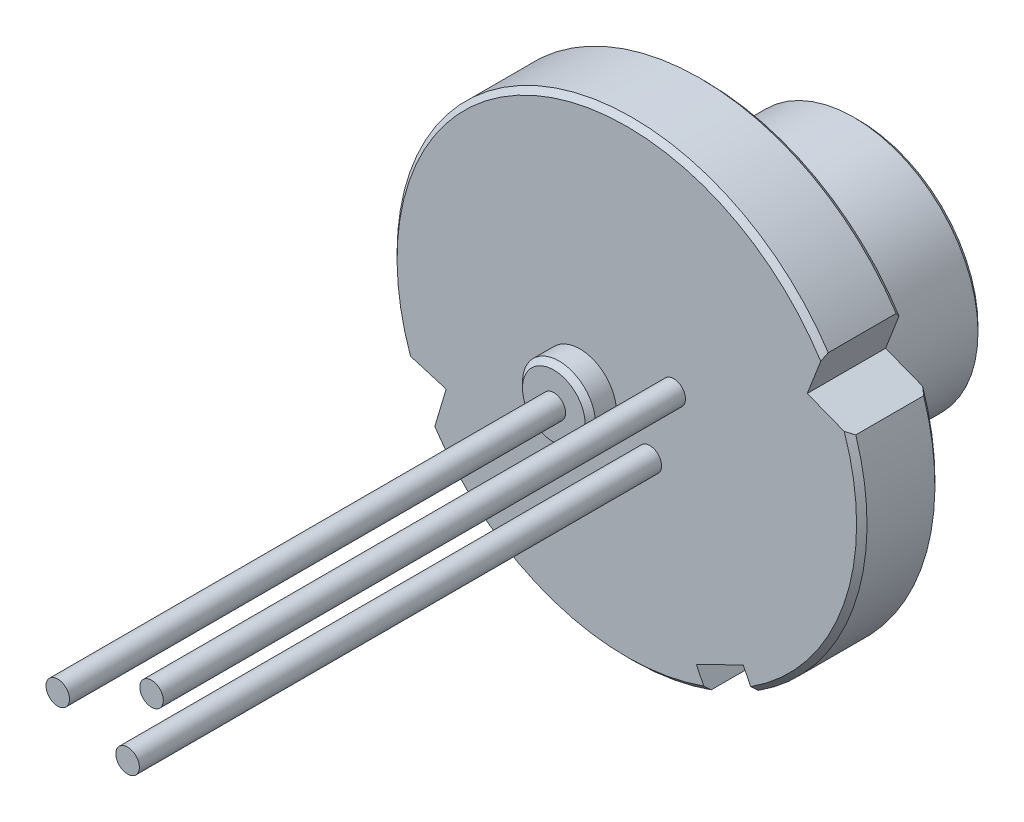
ISO-10303-21;
HEADER;
FILE_DESCRIPTION(('STEP AP214'),'2;1');
FILE_NAME('part.step','',(''),(''),'','','');
FILE_SCHEMA(('AUTOMOTIVE_DESIGN { 1 0 10303 214 1 1 1 1 }'));
ENDSEC;
DATA;
#1=APPLICATION_CONTEXT('core data for automotive mechanical design processes');
#2=APPLICATION_PROTOCOL_DEFINITION('international standard','automotive_design',2000,#1);
#3=PRODUCT_CONTEXT('',#1,'mechanical');
#4=PRODUCT('Part','Part','',(#3));
#5=PRODUCT_RELATED_PRODUCT_CATEGORY('part','',(#4));
#6=PRODUCT_DEFINITION_FORMATION('','',#4);
#7=PRODUCT_DEFINITION_CONTEXT('part definition',#1,'design');
#8=PRODUCT_DEFINITION('design','',#6,#7);
#9=PRODUCT_DEFINITION_SHAPE('','',#8);
#10=(LENGTH_UNIT() NAMED_UNIT(*) SI_UNIT(.MILLI.,.METRE.));
#11=(NAMED_UNIT(*) PLANE_ANGLE_UNIT() SI_UNIT($,.RADIAN.));
#12=(NAMED_UNIT(*) SI_UNIT($,.STERADIAN.) SOLID_ANGLE_UNIT());
#13=UNCERTAINTY_MEASURE_WITH_UNIT(LENGTH_MEASURE(1.E-05),#10,'distance_accuracy_value','');
#14=(GEOMETRIC_REPRESENTATION_CONTEXT(3) GLOBAL_UNCERTAINTY_ASSIGNED_CONTEXT((#13)) GLOBAL_UNIT_ASSIGNED_CONTEXT((#10,
#11,#12)) REPRESENTATION_CONTEXT('',''));
#15=CARTESIAN_POINT('',(0.,0.,0.));
#16=DIRECTION('',(0.,0.,1.));
#17=DIRECTION('',(1.,0.,0.));
#18=AXIS2_PLACEMENT_3D('',#15,#16,#17);
#19=CARTESIAN_POINT('',(0.,0.,2.5414));
#20=DIRECTION('',(0.,0.,-1.));
#21=DIRECTION('',(-0.898157902451115,-0.439673040183968,0.));
#22=AXIS2_PLACEMENT_3D('',#19,#20,#21);
#23=PLANE('',#22);
#24=CARTESIAN_POINT('',(0.439673040183968,-0.898157902451115,2.5414));
#25=DIRECTION('',(0.,0.,-1.));
#26=DIRECTION('',(-0.898157902451115,-0.439673040183968,0.));
#27=AXIS2_PLACEMENT_3D('',#24,#25,#26);
#28=CIRCLE('',#27,0.225);
#29=CARTESIAN_POINT('',(0.237587512132467,-0.997084336492508,2.5414));
#30=VERTEX_POINT('',#29);
#31=EDGE_CURVE('E217',#30,#30,#28,.F.);
#32=ORIENTED_EDGE('',*,*,#31,.F.);
#33=EDGE_LOOP('',(#32));
#34=FACE_BOUND('',#33,.T.);
#35=CARTESIAN_POINT('',(0.898157902451115,0.439673040183968,2.5414));
#36=DIRECTION('',(0.,0.,-1.));
#37=DIRECTION('',(-0.898157902451115,-0.439673040183968,0.));
#38=AXIS2_PLACEMENT_3D('',#35,#36,#37);
#39=CIRCLE('',#38,0.225);
#40=CARTESIAN_POINT('',(0.696072374399615,0.340746606142575,2.5414));
#41=VERTEX_POINT('',#40);
#42=EDGE_CURVE('E214',#41,#41,#39,.F.);
#43=ORIENTED_EDGE('',*,*,#42,.F.);
#44=EDGE_LOOP('',(#43));
#45=FACE_BOUND('',#44,.T.);
#46=DIRECTION('',(0.285871853448172,0.958267855772125,0.));
#47=VECTOR('',#46,1.);
#48=CARTESIAN_POINT('',(-3.46036549749903,-1.68771165301373,2.5414));
#49=LINE('',#48,#47);
#50=CARTESIAN_POINT('',(-3.67754397528226,-2.41571320935767,2.5414));
#51=VERTEX_POINT('',#50);
#52=CARTESIAN_POINT('',(-3.46036549749903,-1.68771165301373,2.5414));
#53=VERTEX_POINT('',#52);
#54=EDGE_CURVE('E189',#51,#53,#49,.T.);
#55=ORIENTED_EDGE('',*,*,#54,.F.);
#56=CARTESIAN_POINT('',(0.,0.,2.5414));
#57=DIRECTION('',(0.,0.,-1.));
#58=DIRECTION('',(-0.898157902451115,-0.439673040183968,0.));
#59=AXIS2_PLACEMENT_3D('',#56,#57,#58);
#60=CIRCLE('',#59,4.4);
#61=CARTESIAN_POINT('',(1.47295112790347,-4.14613253222903,2.5414));
#62=VERTEX_POINT('',#61);
#63=EDGE_CURVE('E470',#51,#62,#60,.F.);
#64=ORIENTED_EDGE('',*,*,#63,.T.);
#65=DIRECTION('',(0.439673040183968,-0.898157902451115,0.));
#66=VECTOR('',#65,1.);
#67=CARTESIAN_POINT('',(1.51719866022514,-4.23652076891062,2.5414));
#68=LINE('',#67,#66);
#69=CARTESIAN_POINT('',(1.33159686151951,-3.857376025019,2.5414));
#70=VERTEX_POINT('',#69);
#71=EDGE_CURVE('E186',#70,#62,#68,.T.);
#72=ORIENTED_EDGE('',*,*,#71,.F.);
#73=DIRECTION('',(-0.898157902451115,-0.439673040183968,0.));
#74=VECTOR('',#73,1.);
#75=CARTESIAN_POINT('',(2.22975476397063,-3.41770298483503,2.5414));
#76=LINE('',#75,#74);
#77=CARTESIAN_POINT('',(2.22975476397063,-3.41770298483503,2.5414));
#78=VERTEX_POINT('',#77);
#79=EDGE_CURVE('E184',#78,#70,#76,.T.);
#80=ORIENTED_EDGE('',*,*,#79,.F.);
#81=DIRECTION('',(-0.439673040183968,0.898157902451115,0.));
#82=VECTOR('',#81,1.);
#83=CARTESIAN_POINT('',(2.41535656267625,-3.79684772872665,2.5414));
#84=LINE('',#83,#82);
#85=CARTESIAN_POINT('',(2.37110903035459,-3.70645949204506,2.5414));
#86=VERTEX_POINT('',#85);
#87=EDGE_CURVE('E182',#86,#78,#84,.T.);
#88=ORIENTED_EDGE('',*,*,#87,.F.);
#89=CARTESIAN_POINT('',(0.,0.,2.5414));
#90=DIRECTION('',(0.,0.,-1.));
#91=DIRECTION('',(-0.898157902451115,-0.439673040183968,0.));
#92=AXIS2_PLACEMENT_3D('',#89,#90,#91);
#93=CIRCLE('',#92,4.4);
#94=CARTESIAN_POINT('',(4.16362447761335,1.4227547959571,2.5414));
#95=VERTEX_POINT('',#94);
#96=EDGE_CURVE('E474',#86,#95,#93,.F.);
#97=ORIENTED_EDGE('',*,*,#96,.T.);
#98=DIRECTION('',(0.932178648237255,-0.361998574265927,0.));
#99=VECTOR('',#98,1.);
#100=CARTESIAN_POINT('',(3.45544304105613,1.69776717780053,2.5414));
#101=LINE('',#100,#99);
#102=CARTESIAN_POINT('',(3.45544304105613,1.69776717780053,2.5414));
#103=VERTEX_POINT('',#102);
#104=EDGE_CURVE('E179',#103,#95,#101,.T.);
#105=ORIENTED_EDGE('',*,*,#104,.F.);
#106=DIRECTION('',(-0.361998574265929,-0.932178648237254,0.));
#107=VECTOR('',#106,1.);
#108=CARTESIAN_POINT('',(3.75763045998787,2.47592676106773,2.5414));
#109=LINE('',#108,#107);
#110=CARTESIAN_POINT('',(3.7129649281498,2.36090902881274,2.5414));
#111=VERTEX_POINT('',#110);
#112=EDGE_CURVE('E153',#111,#103,#109,.T.);
#113=ORIENTED_EDGE('',*,*,#112,.F.);
#114=CARTESIAN_POINT('',(0.,0.,2.5414));
#115=DIRECTION('',(0.,0.,-1.));
#116=DIRECTION('',(-0.898157902451115,-0.439673040183968,0.));
#117=AXIS2_PLACEMENT_3D('',#114,#115,#116);
#118=CIRCLE('',#117,4.4);
#119=CARTESIAN_POINT('',(-4.14206692977694,-1.48434549524301,2.5414));
#120=VERTEX_POINT('',#119);
#121=EDGE_CURVE('E475',#111,#120,#118,.F.);
#122=ORIENTED_EDGE('',*,*,#121,.T.);
#123=DIRECTION('',(-0.958267855772124,0.285871853448176,0.));
#124=VECTOR('',#123,1.);
#125=CARTESIAN_POINT('',(-3.46036549749903,-1.68771165301373,2.5414));
#126=LINE('',#125,#124);
#127=EDGE_CURVE('E146',#53,#120,#126,.T.);
#128=ORIENTED_EDGE('',*,*,#127,.F.);
#129=EDGE_LOOP('',(#55,#64,#72,#80,#88,#97,#105,#113,#122,#128));
#130=FACE_BOUND('',#129,.T.);
#131=CARTESIAN_POINT('',(-0.898157902451115,-0.439673040183968,2.5414));
#132=DIRECTION('',(0.,0.,-1.));
#133=DIRECTION('',(-0.898157902451115,-0.439673040183968,0.));
#134=AXIS2_PLACEMENT_3D('',#131,#132,#133);
#135=CIRCLE('',#134,0.7);
#136=CARTESIAN_POINT('',(-1.5268684341669,-0.747444168312745,2.5414));
#137=VERTEX_POINT('',#136);
#138=EDGE_CURVE('E220',#137,#137,#135,.F.);
#139=ORIENTED_EDGE('',*,*,#138,.F.);
#140=EDGE_LOOP('',(#139));
#141=FACE_BOUND('',#140,.T.);
#142=ADVANCED_FACE('F17',(#34,#45,#130,#141),#23,.F.);
#143=CARTESIAN_POINT('',(0.,0.,0.841399999999998));
#144=DIRECTION('',(0.,0.,-1.));
#145=DIRECTION('',(-0.898157902451115,-0.439673040183968,0.));
#146=AXIS2_PLACEMENT_3D('',#143,#144,#145);
#147=PLANE('',#146);
#148=CARTESIAN_POINT('',(0.,0.,0.841399999999998));
#149=DIRECTION('',(0.,0.,-1.));
#150=DIRECTION('',(-0.898157902451115,-0.439673040183968,0.));
#151=AXIS2_PLACEMENT_3D('',#148,#149,#150);
#152=CIRCLE('',#151,2.575);
#153=CARTESIAN_POINT('',(-2.31275659881162,-1.13215807847372,0.841399999999998));
#154=VERTEX_POINT('',#153);
#155=EDGE_CURVE('E342',#154,#154,#152,.T.);
#156=ORIENTED_EDGE('',*,*,#155,.T.);
#157=EDGE_LOOP('',(#156));
#158=FACE_BOUND('',#157,.T.);
#159=CARTESIAN_POINT('',(0.,0.,0.841399999999998));
#160=DIRECTION('',(0.,0.,-1.));
#161=DIRECTION('',(-0.898157902451115,-0.439673040183968,0.));
#162=AXIS2_PLACEMENT_3D('',#159,#160,#161);
#163=CIRCLE('',#162,2.375);
#164=CARTESIAN_POINT('',(-2.1331250183214,-1.04422347043692,0.841399999999998));
#165=VERTEX_POINT('',#164);
#166=EDGE_CURVE('E446',#165,#165,#163,.T.);
#167=ORIENTED_EDGE('',*,*,#166,.F.);
#168=EDGE_LOOP('',(#167));
#169=FACE_BOUND('',#168,.T.);
#170=ADVANCED_FACE('F363',(#158,#169),#147,.T.);
#171=CARTESIAN_POINT('',(0.,0.,1.0414));
#172=DIRECTION('',(0.,0.,-1.));
#173=DIRECTION('',(-0.898157902451115,-0.439673040183968,0.));
#174=AXIS2_PLACEMENT_3D('',#171,#172,#173);
#175=PLANE('',#174);
#176=DIRECTION('',(0.439673040183968,-0.898157902451115,0.));
#177=VECTOR('',#176,1.);
#178=CARTESIAN_POINT('',(1.51719866022514,-4.23652076891062,1.0414));
#179=LINE('',#178,#177);
#180=CARTESIAN_POINT('',(1.33159686151951,-3.857376025019,1.0414));
#181=VERTEX_POINT('',#180);
#182=CARTESIAN_POINT('',(1.47295112790348,-4.14613253222903,1.0414));
#183=VERTEX_POINT('',#182);
#184=EDGE_CURVE('E171',#181,#183,#179,.T.);
#185=ORIENTED_EDGE('',*,*,#184,.T.);
#186=CARTESIAN_POINT('',(0.,0.,1.0414));
#187=DIRECTION('',(0.,0.,-1.));
#188=DIRECTION('',(-0.898157902451115,-0.439673040183968,0.));
#189=AXIS2_PLACEMENT_3D('',#186,#187,#188);
#190=CIRCLE('',#189,4.4);
#191=CARTESIAN_POINT('',(-3.67754397528226,-2.41571320935767,1.0414));
#192=VERTEX_POINT('',#191);
#193=EDGE_CURVE('E486',#183,#192,#190,.T.);
#194=ORIENTED_EDGE('',*,*,#193,.T.);
#195=DIRECTION('',(0.285871853448172,0.958267855772125,0.));
#196=VECTOR('',#195,1.);
#197=CARTESIAN_POINT('',(-3.46036549749903,-1.68771165301373,1.0414));
#198=LINE('',#197,#196);
#199=CARTESIAN_POINT('',(-3.46036549749903,-1.68771165301373,1.0414));
#200=VERTEX_POINT('',#199);
#201=EDGE_CURVE('E173',#192,#200,#198,.T.);
#202=ORIENTED_EDGE('',*,*,#201,.T.);
#203=DIRECTION('',(-0.958267855772124,0.285871853448176,0.));
#204=VECTOR('',#203,1.);
#205=CARTESIAN_POINT('',(-3.46036549749903,-1.68771165301373,1.0414));
#206=LINE('',#205,#204);
#207=CARTESIAN_POINT('',(-4.14206692977694,-1.48434549524301,1.0414));
#208=VERTEX_POINT('',#207);
#209=EDGE_CURVE('E175',#200,#208,#206,.T.);
#210=ORIENTED_EDGE('',*,*,#209,.T.);
#211=CARTESIAN_POINT('',(0.,0.,1.0414));
#212=DIRECTION('',(0.,0.,-1.));
#213=DIRECTION('',(-0.898157902451115,-0.439673040183968,0.));
#214=AXIS2_PLACEMENT_3D('',#211,#212,#213);
#215=CIRCLE('',#214,4.4);
#216=CARTESIAN_POINT('',(3.7129649281498,2.36090902881274,1.0414));
#217=VERTEX_POINT('',#216);
#218=EDGE_CURVE('E144',#208,#217,#215,.T.);
#219=ORIENTED_EDGE('',*,*,#218,.T.);
#220=DIRECTION('',(-0.361998574265929,-0.932178648237254,0.));
#221=VECTOR('',#220,1.);
#222=CARTESIAN_POINT('',(3.75763045998787,2.47592676106773,1.0414));
#223=LINE('',#222,#221);
#224=CARTESIAN_POINT('',(3.45544304105613,1.69776717780053,1.0414));
#225=VERTEX_POINT('',#224);
#226=EDGE_CURVE('E133',#217,#225,#223,.T.);
#227=ORIENTED_EDGE('',*,*,#226,.T.);
#228=DIRECTION('',(0.932178648237255,-0.361998574265927,0.));
#229=VECTOR('',#228,1.);
#230=CARTESIAN_POINT('',(3.45544304105613,1.69776717780053,1.0414));
#231=LINE('',#230,#229);
#232=CARTESIAN_POINT('',(4.16362447761335,1.42275479595711,1.0414));
#233=VERTEX_POINT('',#232);
#234=EDGE_CURVE('E140',#225,#233,#231,.T.);
#235=ORIENTED_EDGE('',*,*,#234,.T.);
#236=CARTESIAN_POINT('',(0.,0.,1.0414));
#237=DIRECTION('',(0.,0.,-1.));
#238=DIRECTION('',(-0.898157902451115,-0.439673040183968,0.));
#239=AXIS2_PLACEMENT_3D('',#236,#237,#238);
#240=CIRCLE('',#239,4.4);
#241=CARTESIAN_POINT('',(2.37110903035459,-3.70645949204506,1.0414));
#242=VERTEX_POINT('',#241);
#243=EDGE_CURVE('E543',#233,#242,#240,.T.);
#244=ORIENTED_EDGE('',*,*,#243,.T.);
#245=DIRECTION('',(-0.439673040183968,0.898157902451115,0.));
#246=VECTOR('',#245,1.);
#247=CARTESIAN_POINT('',(2.41535656267625,-3.79684772872665,1.0414));
#248=LINE('',#247,#246);
#249=CARTESIAN_POINT('',(2.22975476397063,-3.41770298483503,1.0414));
#250=VERTEX_POINT('',#249);
#251=EDGE_CURVE('E164',#242,#250,#248,.T.);
#252=ORIENTED_EDGE('',*,*,#251,.T.);
#253=DIRECTION('',(-0.898157902451115,-0.439673040183968,0.));
#254=VECTOR('',#253,1.);
#255=CARTESIAN_POINT('',(2.22975476397063,-3.41770298483503,1.0414));
#256=LINE('',#255,#254);
#257=EDGE_CURVE('E166',#250,#181,#256,.T.);
#258=ORIENTED_EDGE('',*,*,#257,.T.);
#259=EDGE_LOOP('',(#185,#194,#202,#210,#219,#227,#235,#244,#252,#258));
#260=FACE_BOUND('',#259,.T.);
#261=CARTESIAN_POINT('',(0.,0.,1.0414));
#262=DIRECTION('',(0.,0.,-1.));
#263=DIRECTION('',(-0.898157902451115,-0.439673040183968,0.));
#264=AXIS2_PLACEMENT_3D('',#261,#262,#263);
#265=CIRCLE('',#264,2.675);
#266=CARTESIAN_POINT('',(-2.40257238905673,-1.17612538249211,1.0414));
#267=VERTEX_POINT('',#266);
#268=EDGE_CURVE('E180',#267,#267,#265,.T.);
#269=ORIENTED_EDGE('',*,*,#268,.F.);
#270=EDGE_LOOP('',(#269));
#271=FACE_BOUND('',#270,.T.);
#272=ADVANCED_FACE('F136',(#260,#271),#175,.T.);
#273=CARTESIAN_POINT('',(0.,0.,1.0414));
#274=DIRECTION('',(0.,0.,1.));
#275=DIRECTION('',(0.898157902451115,0.439673040183968,0.));
#276=AXIS2_PLACEMENT_3D('',#273,#274,#275);
#277=CYLINDRICAL_SURFACE('',#276,4.5);
#278=DIRECTION('',(0.,0.,1.));
#279=VECTOR('',#278,1.);
#280=CARTESIAN_POINT('',(-4.2603037032454,-1.44907292988087,1.0414));
#281=LINE('',#280,#279);
#282=CARTESIAN_POINT('',(-4.2603037032454,-1.44907292988087,1.1414));
#283=VERTEX_POINT('',#282);
#284=CARTESIAN_POINT('',(-4.2603037032454,-1.44907292988087,2.4414));
#285=VERTEX_POINT('',#284);
#286=EDGE_CURVE('E177',#283,#285,#281,.T.);
#287=ORIENTED_EDGE('',*,*,#286,.T.);
#288=CARTESIAN_POINT('',(0.,0.,2.4414));
#289=DIRECTION('',(0.,0.,-1.));
#290=DIRECTION('',(-0.898157902451115,-0.439673040183968,0.));
#291=AXIS2_PLACEMENT_3D('',#288,#289,#290);
#292=CIRCLE('',#291,4.5);
#293=CARTESIAN_POINT('',(3.75763045998787,2.47592676106773,2.4414));
#294=VERTEX_POINT('',#293);
#295=EDGE_CURVE('E761',#285,#294,#292,.T.);
#296=ORIENTED_EDGE('',*,*,#295,.T.);
#297=DIRECTION('',(0.,0.,1.));
#298=VECTOR('',#297,1.);
#299=CARTESIAN_POINT('',(3.75763045998787,2.47592676106773,1.0414));
#300=LINE('',#299,#298);
#301=CARTESIAN_POINT('',(3.75763045998787,2.47592676106773,1.1414));
#302=VERTEX_POINT('',#301);
#303=EDGE_CURVE('E157',#302,#294,#300,.T.);
#304=ORIENTED_EDGE('',*,*,#303,.F.);
#305=CARTESIAN_POINT('',(0.,0.,1.1414));
#306=DIRECTION('',(0.,0.,-1.));
#307=DIRECTION('',(-0.898157902451115,-0.439673040183968,0.));
#308=AXIS2_PLACEMENT_3D('',#305,#306,#307);
#309=CIRCLE('',#308,4.5);
#310=EDGE_CURVE('E39',#302,#283,#309,.F.);
#311=ORIENTED_EDGE('',*,*,#310,.T.);
#312=EDGE_LOOP('',(#287,#296,#304,#311));
#313=FACE_BOUND('',#312,.T.);
#314=ADVANCED_FACE('F300',(#313),#277,.T.);
#315=CARTESIAN_POINT('',(3.75763045998787,2.47592676106773,1.0414));
#316=DIRECTION('',(-0.932178648237254,0.361998574265929,0.));
#317=DIRECTION('',(0.361998574265929,0.932178648237254,0.));
#318=AXIS2_PLACEMENT_3D('',#315,#316,#317);
#319=PLANE('',#318);
#320=ORIENTED_EDGE('',*,*,#303,.T.);
#321=CARTESIAN_POINT('',(3.75763045998787,2.47592676106773,2.4414));
#322=CARTESIAN_POINT('',(3.75020352803988,2.45680174821963,2.45812571174699));
#323=CARTESIAN_POINT('',(3.74276793449911,2.43765443099681,2.47482190076152));
#324=CARTESIAN_POINT('',(3.72787942388722,2.39931518691388,2.50815523409759));
#325=CARTESIAN_POINT('',(3.7204265068153,2.3801232600517,2.52479237841639));
#326=CARTESIAN_POINT('',(3.7129649281498,2.36090902881274,2.5414));
#327=B_SPLINE_CURVE_WITH_KNOTS('',3,(#321,#322,#323,#324,#325,#326),.UNSPECIFIED.,.F.,.F.,(4,2,
4),(0.,0.0794105460357218,0.158821095749479),.UNSPECIFIED.);
#328=EDGE_CURVE('E317',#294,#111,#327,.T.);
#329=ORIENTED_EDGE('',*,*,#328,.T.);
#330=ORIENTED_EDGE('',*,*,#112,.T.);
#331=DIRECTION('',(0.,0.,1.));
#332=VECTOR('',#331,1.);
#333=CARTESIAN_POINT('',(3.45544304105613,1.69776717780053,1.0414));
#334=LINE('',#333,#332);
#335=EDGE_CURVE('E149',#225,#103,#334,.T.);
#336=ORIENTED_EDGE('',*,*,#335,.F.);
#337=ORIENTED_EDGE('',*,*,#226,.F.);
#338=CARTESIAN_POINT('',(3.7129649281498,2.36090902881274,1.0414));
#339=CARTESIAN_POINT('',(3.7204265068153,2.3801232600517,1.0580076215836));
#340=CARTESIAN_POINT('',(3.72787942388722,2.39931518691388,1.07464476590241));
#341=CARTESIAN_POINT('',(3.74276793449911,2.43765443099681,1.10797809923848));
#342=CARTESIAN_POINT('',(3.75020352803988,2.45680174821963,1.12467428825301));
#343=CARTESIAN_POINT('',(3.75763045998787,2.47592676106773,1.1414));
#344=B_SPLINE_CURVE_WITH_KNOTS('',3,(#338,#339,#340,#341,#342,#343),.UNSPECIFIED.,.F.,.F.,(4,2,
4),(0.,0.079410549713759,0.158821095749482),.UNSPECIFIED.);
#345=EDGE_CURVE('E310',#217,#302,#344,.T.);
#346=ORIENTED_EDGE('',*,*,#345,.T.);
#347=EDGE_LOOP('',(#320,#329,#330,#336,#337,#346));
#348=FACE_BOUND('',#347,.T.);
#349=ADVANCED_FACE('F151',(#348),#319,.F.);
#350=CARTESIAN_POINT('',(3.45544304105613,1.69776717780053,1.0414));
#351=DIRECTION('',(-0.361998574265927,-0.932178648237255,0.));
#352=DIRECTION('',(-0.932178648237255,0.361998574265927,0.));
#353=AXIS2_PLACEMENT_3D('',#350,#351,#352);
#354=PLANE('',#353);
#355=DIRECTION('',(0.,0.,1.));
#356=VECTOR('',#355,1.);
#357=CARTESIAN_POINT('',(4.28452590313703,1.37580441391494,1.0414));
#358=LINE('',#357,#356);
#359=CARTESIAN_POINT('',(4.28452590313703,1.37580441391494,1.1414));
#360=VERTEX_POINT('',#359);
#361=CARTESIAN_POINT('',(4.28452590313703,1.37580441391494,2.4414));
#362=VERTEX_POINT('',#361);
#363=EDGE_CURVE('E158',#360,#362,#358,.T.);
#364=ORIENTED_EDGE('',*,*,#363,.F.);
#365=CARTESIAN_POINT('',(4.28452590313703,1.37580441391494,1.1414));
#366=CARTESIAN_POINT('',(4.26443324862861,1.38360711600323,1.12465321744534));
#367=CARTESIAN_POINT('',(4.24431180297065,1.39142099873282,1.10794649315469));
#368=CARTESIAN_POINT('',(4.20401132780053,1.40707112607848,1.07461315981517));
#369=CARTESIAN_POINT('',(4.18383229828394,1.41490737069629,1.05798655077248));
#370=CARTESIAN_POINT('',(4.16362447761335,1.42275479595711,1.0414));
#371=B_SPLINE_CURVE_WITH_KNOTS('',3,(#365,#366,#367,#368,#369,#370),.UNSPECIFIED.,.F.,.F.,(4,2,
4),(0.,0.0818864810381797,0.163772968395991),.UNSPECIFIED.);
#372=EDGE_CURVE('E163',#360,#233,#371,.T.);
#373=ORIENTED_EDGE('',*,*,#372,.T.);
#374=ORIENTED_EDGE('',*,*,#234,.F.);
#375=ORIENTED_EDGE('',*,*,#335,.T.);
#376=ORIENTED_EDGE('',*,*,#104,.T.);
#377=CARTESIAN_POINT('',(4.16362447761335,1.4227547959571,2.5414));
#378=CARTESIAN_POINT('',(4.18383229828394,1.41490737069629,2.52481344922751));
#379=CARTESIAN_POINT('',(4.20401132780053,1.40707112607848,2.50818684018482));
#380=CARTESIAN_POINT('',(4.24431180297065,1.39142099873282,2.47485350684531));
#381=CARTESIAN_POINT('',(4.26443324862861,1.38360711600323,2.45814678255466));
#382=CARTESIAN_POINT('',(4.28452590313703,1.37580441391494,2.4414));
#383=B_SPLINE_CURVE_WITH_KNOTS('',3,(#377,#378,#379,#380,#381,#382),.UNSPECIFIED.,.F.,.F.,(4,2,
4),(0.,0.0818864873578094,0.163772968395988),.UNSPECIFIED.);
#384=EDGE_CURVE('E502',#95,#362,#383,.T.);
#385=ORIENTED_EDGE('',*,*,#384,.T.);
#386=EDGE_LOOP('',(#364,#373,#374,#375,#376,#385));
#387=FACE_BOUND('',#386,.T.);
#388=ADVANCED_FACE('F161',(#387),#354,.F.);
#389=CARTESIAN_POINT('',(0.,0.,1.0414));
#390=DIRECTION('',(0.,0.,1.));
#391=DIRECTION('',(0.898157902451115,0.439673040183968,0.));
#392=AXIS2_PLACEMENT_3D('',#389,#390,#391);
#393=CYLINDRICAL_SURFACE('',#392,4.5);
#394=DIRECTION('',(0.,0.,1.));
#395=VECTOR('',#394,1.);
#396=CARTESIAN_POINT('',(2.41535656267626,-3.79684772872665,1.0414));
#397=LINE('',#396,#395);
#398=CARTESIAN_POINT('',(2.41535656267626,-3.79684772872665,1.1414));
#399=VERTEX_POINT('',#398);
#400=CARTESIAN_POINT('',(2.41535656267626,-3.79684772872665,2.4414));
#401=VERTEX_POINT('',#400);
#402=EDGE_CURVE('E208',#399,#401,#397,.T.);
#403=ORIENTED_EDGE('',*,*,#402,.F.);
#404=CARTESIAN_POINT('',(0.,0.,1.1414));
#405=DIRECTION('',(0.,0.,-1.));
#406=DIRECTION('',(-0.898157902451115,-0.439673040183968,0.));
#407=AXIS2_PLACEMENT_3D('',#404,#405,#406);
#408=CIRCLE('',#407,4.5);
#409=EDGE_CURVE('E504',#399,#360,#408,.F.);
#410=ORIENTED_EDGE('',*,*,#409,.T.);
#411=ORIENTED_EDGE('',*,*,#363,.T.);
#412=CARTESIAN_POINT('',(0.,0.,2.4414));
#413=DIRECTION('',(0.,0.,-1.));
#414=DIRECTION('',(-0.898157902451115,-0.439673040183968,0.));
#415=AXIS2_PLACEMENT_3D('',#412,#413,#414);
#416=CIRCLE('',#415,4.5);
#417=EDGE_CURVE('E503',#362,#401,#416,.T.);
#418=ORIENTED_EDGE('',*,*,#417,.T.);
#419=EDGE_LOOP('',(#403,#410,#411,#418));
#420=FACE_BOUND('',#419,.T.);
#421=ADVANCED_FACE('F534',(#420),#393,.T.);
#422=CARTESIAN_POINT('',(2.41535656267625,-3.79684772872665,1.0414));
#423=DIRECTION('',(0.898157902451115,0.439673040183968,0.));
#424=DIRECTION('',(0.,0.,-1.));
#425=AXIS2_PLACEMENT_3D('',#422,#423,#424);
#426=PLANE('',#425);
#427=ORIENTED_EDGE('',*,*,#251,.F.);
#428=CARTESIAN_POINT('',(2.37110903035459,-3.70645949204506,1.0414));
#429=CARTESIAN_POINT('',(2.37848414550879,-3.72152527355047,1.05806546170544));
#430=CARTESIAN_POINT('',(2.38585899744608,-3.73659051736008,1.07473152589161));
#431=CARTESIAN_POINT('',(2.40060817488663,-3.76671992958728,1.10806485922495));
#432=CARTESIAN_POINT('',(2.4079825003899,-3.78178409800486,1.12473212837211));
#433=CARTESIAN_POINT('',(2.41535656267625,-3.79684772872665,1.1414));
#434=B_SPLINE_CURVE_WITH_KNOTS('',3,(#428,#429,#430,#431,#432,#433),.UNSPECIFIED.,.F.,.F.,(4,2,
4),(0.,0.0709363754950862,0.141872750988116),.UNSPECIFIED.);
#435=EDGE_CURVE('E522',#242,#399,#434,.T.);
#436=ORIENTED_EDGE('',*,*,#435,.T.);
#437=ORIENTED_EDGE('',*,*,#402,.T.);
#438=CARTESIAN_POINT('',(2.41535656267626,-3.79684772872665,2.4414));
#439=CARTESIAN_POINT('',(2.4079825003899,-3.78178409800486,2.45806787162789));
#440=CARTESIAN_POINT('',(2.40060817488663,-3.76671992958728,2.47473514077505));
#441=CARTESIAN_POINT('',(2.38585899744608,-3.73659051736008,2.50806847410838));
#442=CARTESIAN_POINT('',(2.37848414550879,-3.72152527355047,2.52473453829456));
#443=CARTESIAN_POINT('',(2.37110903035459,-3.70645949204506,2.5414));
#444=B_SPLINE_CURVE_WITH_KNOTS('',3,(#438,#439,#440,#441,#442,#443),.UNSPECIFIED.,.F.,.F.,(4,2,
4),(0.,0.0709363754930282,0.141872750988113),.UNSPECIFIED.);
#445=EDGE_CURVE('E500',#401,#86,#444,.T.);
#446=ORIENTED_EDGE('',*,*,#445,.T.);
#447=ORIENTED_EDGE('',*,*,#87,.T.);
#448=DIRECTION('',(0.,0.,1.));
#449=VECTOR('',#448,1.);
#450=CARTESIAN_POINT('',(2.22975476397063,-3.41770298483503,1.0414));
#451=LINE('',#450,#449);
#452=EDGE_CURVE('E205',#250,#78,#451,.T.);
#453=ORIENTED_EDGE('',*,*,#452,.F.);
#454=EDGE_LOOP('',(#427,#436,#437,#446,#447,#453));
#455=FACE_BOUND('',#454,.T.);
#456=ADVANCED_FACE('F531',(#455),#426,.F.);
#457=CARTESIAN_POINT('',(2.22975476397063,-3.41770298483503,1.0414));
#458=DIRECTION('',(-0.439673040183968,0.898157902451115,0.));
#459=DIRECTION('',(0.,0.,-1.));
#460=AXIS2_PLACEMENT_3D('',#457,#458,#459);
#461=PLANE('',#460);
#462=ORIENTED_EDGE('',*,*,#79,.T.);
#463=DIRECTION('',(0.,0.,1.));
#464=VECTOR('',#463,1.);
#465=CARTESIAN_POINT('',(1.33159686151951,-3.857376025019,1.0414));
#466=LINE('',#465,#464);
#467=EDGE_CURVE('E202',#181,#70,#466,.T.);
#468=ORIENTED_EDGE('',*,*,#467,.F.);
#469=ORIENTED_EDGE('',*,*,#257,.F.);
#470=ORIENTED_EDGE('',*,*,#452,.T.);
#471=EDGE_LOOP('',(#462,#468,#469,#470));
#472=FACE_BOUND('',#471,.T.);
#473=ADVANCED_FACE('F272',(#472),#461,.F.);
#474=CARTESIAN_POINT('',(1.51719866022514,-4.23652076891062,1.0414));
#475=DIRECTION('',(-0.898157902451115,-0.439673040183968,0.));
#476=DIRECTION('',(0.,0.,1.));
#477=AXIS2_PLACEMENT_3D('',#474,#475,#476);
#478=PLANE('',#477);
#479=ORIENTED_EDGE('',*,*,#71,.T.);
#480=CARTESIAN_POINT('',(1.47295112790347,-4.14613253222903,2.5414));
#481=CARTESIAN_POINT('',(1.48032624305767,-4.16119831373443,2.52473453829456));
#482=CARTESIAN_POINT('',(1.48770109499496,-4.17626355754405,2.50806847410838));
#483=CARTESIAN_POINT('',(1.50245027243552,-4.20639296977124,2.47473514077505));
#484=CARTESIAN_POINT('',(1.50982459793878,-4.22145713818883,2.45806787162789));
#485=CARTESIAN_POINT('',(1.51719866022514,-4.23652076891062,2.4414));
#486=B_SPLINE_CURVE_WITH_KNOTS('',3,(#480,#481,#482,#483,#484,#485),.UNSPECIFIED.,.F.,.F.,(4,2,
4),(0.,0.0709363754950839,0.14187275098811),.UNSPECIFIED.);
#487=CARTESIAN_POINT('',(1.51719866022514,-4.23652076891062,2.4414));
#488=VERTEX_POINT('',#487);
#489=EDGE_CURVE('E283',#62,#488,#486,.T.);
#490=ORIENTED_EDGE('',*,*,#489,.T.);
#491=DIRECTION('',(0.,0.,1.));
#492=VECTOR('',#491,1.);
#493=CARTESIAN_POINT('',(1.51719866022514,-4.23652076891062,1.0414));
#494=LINE('',#493,#492);
#495=CARTESIAN_POINT('',(1.51719866022514,-4.23652076891062,1.14139999999999));
#496=VERTEX_POINT('',#495);
#497=EDGE_CURVE('E199',#496,#488,#494,.T.);
#498=ORIENTED_EDGE('',*,*,#497,.F.);
#499=CARTESIAN_POINT('',(1.51719866022514,-4.23652076891062,1.14139999999999));
#500=CARTESIAN_POINT('',(1.50982459793878,-4.22145713818883,1.1247321283721));
#501=CARTESIAN_POINT('',(1.50245027243552,-4.20639296977124,1.10806485922494));
#502=CARTESIAN_POINT('',(1.48770109499496,-4.17626355754405,1.07473152589161));
#503=CARTESIAN_POINT('',(1.48032624305767,-4.16119831373444,1.05806546170544));
#504=CARTESIAN_POINT('',(1.47295112790348,-4.14613253222903,1.0414));
#505=B_SPLINE_CURVE_WITH_KNOTS('',3,(#499,#500,#501,#502,#503,#504),.UNSPECIFIED.,.F.,.F.,(4,2,
4),(0.,0.0709363754930249,0.141872750988106),.UNSPECIFIED.);
#506=EDGE_CURVE('E277',#496,#183,#505,.T.);
#507=ORIENTED_EDGE('',*,*,#506,.T.);
#508=ORIENTED_EDGE('',*,*,#184,.F.);
#509=ORIENTED_EDGE('',*,*,#467,.T.);
#510=EDGE_LOOP('',(#479,#490,#498,#507,#508,#509));
#511=FACE_BOUND('',#510,.T.);
#512=ADVANCED_FACE('F267',(#511),#478,.F.);
#513=CARTESIAN_POINT('',(0.,0.,1.0414));
#514=DIRECTION('',(0.,0.,1.));
#515=DIRECTION('',(0.898157902451115,0.439673040183968,0.));
#516=AXIS2_PLACEMENT_3D('',#513,#514,#515);
#517=CYLINDRICAL_SURFACE('',#516,4.5);
#518=ORIENTED_EDGE('',*,*,#497,.T.);
#519=CARTESIAN_POINT('',(0.,0.,2.4414));
#520=DIRECTION('',(0.,0.,-1.));
#521=DIRECTION('',(-0.898157902451115,-0.439673040183968,0.));
#522=AXIS2_PLACEMENT_3D('',#519,#520,#521);
#523=CIRCLE('',#522,4.5);
#524=CARTESIAN_POINT('',(-3.71462089681907,-2.53999834506149,2.4414));
#525=VERTEX_POINT('',#524);
#526=EDGE_CURVE('E235',#488,#525,#523,.T.);
#527=ORIENTED_EDGE('',*,*,#526,.T.);
#528=DIRECTION('',(0.,0.,1.));
#529=VECTOR('',#528,1.);
#530=CARTESIAN_POINT('',(-3.71462089681907,-2.53999834506149,1.0414));
#531=LINE('',#530,#529);
#532=CARTESIAN_POINT('',(-3.71462089681907,-2.53999834506149,1.14139999999999));
#533=VERTEX_POINT('',#532);
#534=EDGE_CURVE('E196',#533,#525,#531,.T.);
#535=ORIENTED_EDGE('',*,*,#534,.F.);
#536=CARTESIAN_POINT('',(0.,0.,1.14139999999999));
#537=DIRECTION('',(0.,0.,-1.));
#538=DIRECTION('',(-0.898157902451115,-0.439673040183968,0.));
#539=AXIS2_PLACEMENT_3D('',#536,#537,#538);
#540=CIRCLE('',#539,4.5);
#541=EDGE_CURVE('E233',#533,#496,#540,.F.);
#542=ORIENTED_EDGE('',*,*,#541,.T.);
#543=EDGE_LOOP('',(#518,#527,#535,#542));
#544=FACE_BOUND('',#543,.T.);
#545=ADVANCED_FACE('F260',(#544),#517,.T.);
#546=CARTESIAN_POINT('',(-3.46036549749903,-1.68771165301373,1.0414));
#547=DIRECTION('',(0.958267855772125,-0.285871853448172,0.));
#548=DIRECTION('',(-0.285871853448172,-0.958267855772125,0.));
#549=AXIS2_PLACEMENT_3D('',#546,#547,#548);
#550=PLANE('',#549);
#551=ORIENTED_EDGE('',*,*,#534,.T.);
#552=CARTESIAN_POINT('',(-3.71462089681907,-2.53999834506149,2.4414));
#553=CARTESIAN_POINT('',(-3.70845906893782,-2.519343350454,2.45814678255466));
#554=CARTESIAN_POINT('',(-3.70228841165536,-2.49865875890907,2.47485350684531));
#555=CARTESIAN_POINT('',(-3.68992943781112,-2.4572303803457,2.50818684018483));
#556=CARTESIAN_POINT('',(-3.68374112124798,-2.43648659332269,2.52481344922751));
#557=CARTESIAN_POINT('',(-3.67754397528226,-2.41571320935767,2.5414));
#558=B_SPLINE_CURVE_WITH_KNOTS('',3,(#552,#553,#554,#555,#556,#557),.UNSPECIFIED.,.F.,.F.,(4,2,
4),(0.,0.0818864810381781,0.163772968395987),.UNSPECIFIED.);
#559=EDGE_CURVE('E245',#525,#51,#558,.T.);
#560=ORIENTED_EDGE('',*,*,#559,.T.);
#561=ORIENTED_EDGE('',*,*,#54,.T.);
#562=DIRECTION('',(0.,0.,1.));
#563=VECTOR('',#562,1.);
#564=CARTESIAN_POINT('',(-3.46036549749903,-1.68771165301373,1.0414));
#565=LINE('',#564,#563);
#566=EDGE_CURVE('E193',#200,#53,#565,.T.);
#567=ORIENTED_EDGE('',*,*,#566,.F.);
#568=ORIENTED_EDGE('',*,*,#201,.F.);
#569=CARTESIAN_POINT('',(-3.67754397528226,-2.41571320935767,1.0414));
#570=CARTESIAN_POINT('',(-3.68374112124798,-2.43648659332269,1.05798655077248));
#571=CARTESIAN_POINT('',(-3.68992943781112,-2.4572303803457,1.07461315981517));
#572=CARTESIAN_POINT('',(-3.70228841165536,-2.49865875890907,1.10794649315468));
#573=CARTESIAN_POINT('',(-3.70845906893782,-2.519343350454,1.12465321744533));
#574=CARTESIAN_POINT('',(-3.71462089681907,-2.53999834506149,1.14139999999999));
#575=B_SPLINE_CURVE_WITH_KNOTS('',3,(#569,#570,#571,#572,#573,#574),.UNSPECIFIED.,.F.,.F.,(4,2,
4),(0.,0.0818864873578063,0.163772968395982),.UNSPECIFIED.);
#576=EDGE_CURVE('E238',#192,#533,#575,.T.);
#577=ORIENTED_EDGE('',*,*,#576,.T.);
#578=EDGE_LOOP('',(#551,#560,#561,#567,#568,#577));
#579=FACE_BOUND('',#578,.T.);
#580=ADVANCED_FACE('F254',(#579),#550,.F.);
#581=CARTESIAN_POINT('',(-3.46036549749903,-1.68771165301373,1.0414));
#582=DIRECTION('',(0.285871853448176,0.958267855772124,0.));
#583=DIRECTION('',(0.958267855772124,-0.285871853448176,0.));
#584=AXIS2_PLACEMENT_3D('',#581,#582,#583);
#585=PLANE('',#584);
#586=ORIENTED_EDGE('',*,*,#127,.T.);
#587=CARTESIAN_POINT('',(-4.14206692977694,-1.48434549524301,2.5414));
#588=CARTESIAN_POINT('',(-4.16181891637788,-1.47845305401702,2.52479237841639));
#589=CARTESIAN_POINT('',(-4.18154797436171,-1.47256745288926,2.50815523409759));
#590=CARTESIAN_POINT('',(-4.22096023218241,-1.46080993110252,2.47482190076152));
#591=CARTESIAN_POINT('',(-4.2406434320214,-1.45493801044289,2.45812571174699));
#592=CARTESIAN_POINT('',(-4.2603037032454,-1.44907292988087,2.4414));
#593=B_SPLINE_CURVE_WITH_KNOTS('',3,(#587,#588,#589,#590,#591,#592),.UNSPECIFIED.,.F.,.F.,(4,2,
4),(0.,0.0794105497137578,0.158821095749479),.UNSPECIFIED.);
#594=EDGE_CURVE('E32',#120,#285,#593,.T.);
#595=ORIENTED_EDGE('',*,*,#594,.T.);
#596=ORIENTED_EDGE('',*,*,#286,.F.);
#597=CARTESIAN_POINT('',(-4.2603037032454,-1.44907292988087,1.1414));
#598=CARTESIAN_POINT('',(-4.2406434320214,-1.45493801044289,1.12467428825301));
#599=CARTESIAN_POINT('',(-4.22096023218241,-1.46080993110252,1.10797809923848));
#600=CARTESIAN_POINT('',(-4.18154797436171,-1.47256745288926,1.07464476590241));
#601=CARTESIAN_POINT('',(-4.16181891637788,-1.47845305401702,1.0580076215836));
#602=CARTESIAN_POINT('',(-4.14206692977694,-1.48434549524301,1.0414));
#603=B_SPLINE_CURVE_WITH_KNOTS('',3,(#597,#598,#599,#600,#601,#602),.UNSPECIFIED.,.F.,.F.,(4,2,
4),(0.,0.0794105460357235,0.158821095749483),.UNSPECIFIED.);
#604=EDGE_CURVE('E323',#283,#208,#603,.T.);
#605=ORIENTED_EDGE('',*,*,#604,.T.);
#606=ORIENTED_EDGE('',*,*,#209,.F.);
#607=ORIENTED_EDGE('',*,*,#566,.T.);
#608=EDGE_LOOP('',(#586,#595,#596,#605,#606,#607));
#609=FACE_BOUND('',#608,.T.);
#610=ADVANCED_FACE('F259',(#609),#585,.F.);
#611=CARTESIAN_POINT('',(0.,0.,0.841399999999998));
#612=DIRECTION('',(0.,0.,1.));
#613=DIRECTION('',(0.898157902451115,0.439673040183968,0.));
#614=AXIS2_PLACEMENT_3D('',#611,#612,#613);
#615=CYLINDRICAL_SURFACE('',#614,2.675);
#616=CARTESIAN_POINT('',(0.,0.,0.941399999999997));
#617=DIRECTION('',(0.,0.,-1.));
#618=DIRECTION('',(-0.898157902451115,-0.439673040183968,0.));
#619=AXIS2_PLACEMENT_3D('',#616,#617,#618);
#620=CIRCLE('',#619,2.675);
#621=CARTESIAN_POINT('',(-2.40257238905673,-1.17612538249211,0.941399999999997));
#622=VERTEX_POINT('',#621);
#623=EDGE_CURVE('E345',#622,#622,#620,.F.);
#624=ORIENTED_EDGE('',*,*,#623,.T.);
#625=EDGE_LOOP('',(#624));
#626=FACE_BOUND('',#625,.T.);
#627=ORIENTED_EDGE('',*,*,#268,.T.);
#628=EDGE_LOOP('',(#627));
#629=FACE_BOUND('',#628,.T.);
#630=ADVANCED_FACE('F377',(#626,#629),#615,.T.);
#631=CARTESIAN_POINT('',(0.,0.,-1.9086));
#632=DIRECTION('',(0.,0.,1.));
#633=DIRECTION('',(0.898157902451115,0.439673040183968,0.));
#634=AXIS2_PLACEMENT_3D('',#631,#632,#633);
#635=CYLINDRICAL_SURFACE('',#634,2.375);
#636=CARTESIAN_POINT('',(0.,0.,-1.80860000000001));
#637=DIRECTION('',(0.,0.,-1.));
#638=DIRECTION('',(-0.898157902451115,-0.439673040183968,0.));
#639=AXIS2_PLACEMENT_3D('',#636,#637,#638);
#640=CIRCLE('',#639,2.375);
#641=CARTESIAN_POINT('',(-2.1331250183214,-1.04422347043692,-1.80860000000001));
#642=VERTEX_POINT('',#641);
#643=EDGE_CURVE('E11',#642,#642,#640,.F.);
#644=ORIENTED_EDGE('',*,*,#643,.T.);
#645=EDGE_LOOP('',(#644));
#646=FACE_BOUND('',#645,.T.);
#647=ORIENTED_EDGE('',*,*,#166,.T.);
#648=EDGE_LOOP('',(#647));
#649=FACE_BOUND('',#648,.T.);
#650=ADVANCED_FACE('F379',(#646,#649),#635,.T.);
#651=CARTESIAN_POINT('',(0.,0.,-1.9086));
#652=DIRECTION('',(0.,0.,-1.));
#653=DIRECTION('',(-0.898157902451115,-0.439673040183968,0.));
#654=AXIS2_PLACEMENT_3D('',#651,#652,#653);
#655=PLANE('',#654);
#656=CARTESIAN_POINT('',(0.,0.,-1.9086));
#657=DIRECTION('',(0.,0.,-1.));
#658=DIRECTION('',(-0.898157902451115,-0.439673040183968,0.));
#659=AXIS2_PLACEMENT_3D('',#656,#657,#658);
#660=CIRCLE('',#659,2.275);
#661=CARTESIAN_POINT('',(-2.04330922807629,-1.00025616641853,-1.9086));
#662=VERTEX_POINT('',#661);
#663=EDGE_CURVE('E25',#662,#662,#660,.T.);
#664=ORIENTED_EDGE('',*,*,#663,.T.);
#665=EDGE_LOOP('',(#664));
#666=FACE_BOUND('',#665,.T.);
#667=CARTESIAN_POINT('',(0.,0.,-1.9086));
#668=DIRECTION('',(0.,0.,-1.));
#669=DIRECTION('',(-0.898157902451115,-0.439673040183968,0.));
#670=AXIS2_PLACEMENT_3D('',#667,#668,#669);
#671=CIRCLE('',#670,1.05);
#672=CARTESIAN_POINT('',(-0.943065797573671,-0.461656692193166,-1.9086));
#673=VERTEX_POINT('',#672);
#674=EDGE_CURVE('E436',#673,#673,#671,.T.);
#675=ORIENTED_EDGE('',*,*,#674,.F.);
#676=EDGE_LOOP('',(#675));
#677=FACE_BOUND('',#676,.T.);
#678=ADVANCED_FACE('F350',(#666,#677),#655,.T.);
#679=CARTESIAN_POINT('',(0.,0.,3.8112484809835));
#680=DIRECTION('',(0.,0.,-1.));
#681=DIRECTION('',(-0.898157902451115,-0.439673040183968,0.));
#682=AXIS2_PLACEMENT_3D('',#679,#680,#681);
#683=CYLINDRICAL_SURFACE('',#682,1.05);
#684=CARTESIAN_POINT('',(0.,0.,0.841399999999998));
#685=DIRECTION('',(0.,0.,-1.));
#686=DIRECTION('',(-0.898157902451115,-0.439673040183968,0.));
#687=AXIS2_PLACEMENT_3D('',#684,#685,#686);
#688=CIRCLE('',#687,1.05);
#689=CARTESIAN_POINT('',(-0.943065797573671,-0.461656692193166,0.841399999999998));
#690=VERTEX_POINT('',#689);
#691=EDGE_CURVE('E443',#690,#690,#688,.F.);
#692=ORIENTED_EDGE('',*,*,#691,.T.);
#693=EDGE_LOOP('',(#692));
#694=FACE_BOUND('',#693,.T.);
#695=ORIENTED_EDGE('',*,*,#674,.T.);
#696=EDGE_LOOP('',(#695));
#697=FACE_BOUND('',#696,.T.);
#698=ADVANCED_FACE('F387',(#694,#697),#683,.F.);
#699=CARTESIAN_POINT('',(0.,0.,0.841399999999998));
#700=DIRECTION('',(0.,0.,-1.));
#701=DIRECTION('',(-0.898157902451115,-0.439673040183968,0.));
#702=AXIS2_PLACEMENT_3D('',#699,#700,#701);
#703=PLANE('',#702);
#704=ORIENTED_EDGE('',*,*,#691,.F.);
#705=EDGE_LOOP('',(#704));
#706=FACE_BOUND('',#705,.T.);
#707=ADVANCED_FACE('F390',(#706),#703,.T.);
#708=CARTESIAN_POINT('',(0.898157902451115,0.439673040183968,12.5414));
#709=DIRECTION('',(0.,0.,-1.));
#710=DIRECTION('',(-0.898157902451115,-0.439673040183968,0.));
#711=AXIS2_PLACEMENT_3D('',#708,#709,#710);
#712=CYLINDRICAL_SURFACE('',#711,0.225);
#713=CARTESIAN_POINT('',(0.898157902451115,0.439673040183968,12.5414));
#714=DIRECTION('',(0.,0.,1.));
#715=DIRECTION('',(0.898157902451115,0.439673040183968,0.));
#716=AXIS2_PLACEMENT_3D('',#713,#714,#715);
#717=CIRCLE('',#716,0.225);
#718=CARTESIAN_POINT('',(1.10024343050262,0.53859947422536,12.5414));
#719=VERTEX_POINT('',#718);
#720=EDGE_CURVE('E433',#719,#719,#717,.T.);
#721=ORIENTED_EDGE('',*,*,#720,.F.);
#722=EDGE_LOOP('',(#721));
#723=FACE_BOUND('',#722,.T.);
#724=ORIENTED_EDGE('',*,*,#42,.T.);
#725=EDGE_LOOP('',(#724));
#726=FACE_BOUND('',#725,.T.);
#727=ADVANCED_FACE('F393',(#723,#726),#712,.T.);
#728=CARTESIAN_POINT('',(0.898157902451115,0.439673040183968,12.5414));
#729=DIRECTION('',(0.,0.,1.));
#730=DIRECTION('',(0.898157902451115,0.439673040183968,0.));
#731=AXIS2_PLACEMENT_3D('',#728,#729,#730);
#732=PLANE('',#731);
#733=ORIENTED_EDGE('',*,*,#720,.T.);
#734=EDGE_LOOP('',(#733));
#735=FACE_BOUND('',#734,.T.);
#736=ADVANCED_FACE('F397',(#735),#732,.T.);
#737=CARTESIAN_POINT('',(0.439673040183968,-0.898157902451115,12.5414));
#738=DIRECTION('',(0.,0.,-1.));
#739=DIRECTION('',(-0.898157902451115,-0.439673040183968,0.));
#740=AXIS2_PLACEMENT_3D('',#737,#738,#739);
#741=CYLINDRICAL_SURFACE('',#740,0.225);
#742=CARTESIAN_POINT('',(0.439673040183968,-0.898157902451115,12.5414));
#743=DIRECTION('',(0.,0.,1.));
#744=DIRECTION('',(0.898157902451115,0.439673040183968,0.));
#745=AXIS2_PLACEMENT_3D('',#742,#743,#744);
#746=CIRCLE('',#745,0.225);
#747=CARTESIAN_POINT('',(0.641758568235469,-0.799231468409723,12.5414));
#748=VERTEX_POINT('',#747);
#749=EDGE_CURVE('E224',#748,#748,#746,.T.);
#750=ORIENTED_EDGE('',*,*,#749,.F.);
#751=EDGE_LOOP('',(#750));
#752=FACE_BOUND('',#751,.T.);
#753=ORIENTED_EDGE('',*,*,#31,.T.);
#754=EDGE_LOOP('',(#753));
#755=FACE_BOUND('',#754,.T.);
#756=ADVANCED_FACE('F401',(#752,#755),#741,.T.);
#757=CARTESIAN_POINT('',(0.439673040183968,-0.898157902451115,12.5414));
#758=DIRECTION('',(0.,0.,1.));
#759=DIRECTION('',(0.898157902451115,0.439673040183968,0.));
#760=AXIS2_PLACEMENT_3D('',#757,#758,#759);
#761=PLANE('',#760);
#762=ORIENTED_EDGE('',*,*,#749,.T.);
#763=EDGE_LOOP('',(#762));
#764=FACE_BOUND('',#763,.T.);
#765=ADVANCED_FACE('F413',(#764),#761,.T.);
#766=CARTESIAN_POINT('',(-0.898157902451115,-0.439673040183968,3.0414));
#767=DIRECTION('',(0.,0.,1.));
#768=DIRECTION('',(0.898157902451115,0.439673040183968,0.));
#769=AXIS2_PLACEMENT_3D('',#766,#767,#768);
#770=PLANE('',#769);
#771=CARTESIAN_POINT('',(-0.898157902451115,-0.439673040183968,3.0414));
#772=DIRECTION('',(0.,0.,1.));
#773=DIRECTION('',(0.898157902451115,0.439673040183968,0.));
#774=AXIS2_PLACEMENT_3D('',#771,#772,#773);
#775=CIRCLE('',#774,0.600000000000007);
#776=CARTESIAN_POINT('',(-0.35926316098044,-0.175869216073584,3.0414));
#777=VERTEX_POINT('',#776);
#778=EDGE_CURVE('E227',#777,#777,#775,.T.);
#779=ORIENTED_EDGE('',*,*,#778,.T.);
#780=EDGE_LOOP('',(#779));
#781=FACE_BOUND('',#780,.T.);
#782=CARTESIAN_POINT('',(-0.898157902451115,-0.439673040183968,3.0414));
#783=DIRECTION('',(0.,0.,1.));
#784=DIRECTION('',(0.898157902451115,0.439673040183968,0.));
#785=AXIS2_PLACEMENT_3D('',#782,#783,#784);
#786=CIRCLE('',#785,0.225);
#787=CARTESIAN_POINT('',(-0.696072374399614,-0.340746606142575,3.0414));
#788=VERTEX_POINT('',#787);
#789=EDGE_CURVE('E221',#788,#788,#786,.T.);
#790=ORIENTED_EDGE('',*,*,#789,.F.);
#791=EDGE_LOOP('',(#790));
#792=FACE_BOUND('',#791,.T.);
#793=ADVANCED_FACE('F417',(#781,#792),#770,.T.);
#794=CARTESIAN_POINT('',(-0.898157902451115,-0.439673040183968,3.0414));
#795=DIRECTION('',(0.,0.,-1.));
#796=DIRECTION('',(-0.898157902451115,-0.439673040183968,0.));
#797=AXIS2_PLACEMENT_3D('',#794,#795,#796);
#798=CYLINDRICAL_SURFACE('',#797,0.7);
#799=CARTESIAN_POINT('',(-0.898157902451115,-0.439673040183968,2.9414));
#800=DIRECTION('',(0.,0.,1.));
#801=DIRECTION('',(0.898157902451115,0.439673040183968,0.));
#802=AXIS2_PLACEMENT_3D('',#799,#800,#801);
#803=CIRCLE('',#802,0.7);
#804=CARTESIAN_POINT('',(-0.269447370735335,-0.13190191205519,2.9414));
#805=VERTEX_POINT('',#804);
#806=EDGE_CURVE('E230',#805,#805,#803,.F.);
#807=ORIENTED_EDGE('',*,*,#806,.T.);
#808=EDGE_LOOP('',(#807));
#809=FACE_BOUND('',#808,.T.);
#810=ORIENTED_EDGE('',*,*,#138,.T.);
#811=EDGE_LOOP('',(#810));
#812=FACE_BOUND('',#811,.T.);
#813=ADVANCED_FACE('F409',(#809,#812),#798,.T.);
#814=CARTESIAN_POINT('',(-0.898157902451115,-0.439673040183968,12.5414));
#815=DIRECTION('',(0.,0.,1.));
#816=DIRECTION('',(0.898157902451115,0.439673040183968,0.));
#817=AXIS2_PLACEMENT_3D('',#814,#815,#816);
#818=PLANE('',#817);
#819=CARTESIAN_POINT('',(-0.898157902451115,-0.439673040183968,12.5414));
#820=DIRECTION('',(0.,0.,1.));
#821=DIRECTION('',(0.898157902451115,0.439673040183968,0.));
#822=AXIS2_PLACEMENT_3D('',#819,#820,#821);
#823=CIRCLE('',#822,0.225);
#824=CARTESIAN_POINT('',(-0.696072374399614,-0.340746606142575,12.5414));
#825=VERTEX_POINT('',#824);
#826=EDGE_CURVE('E432',#825,#825,#823,.T.);
#827=ORIENTED_EDGE('',*,*,#826,.T.);
#828=EDGE_LOOP('',(#827));
#829=FACE_BOUND('',#828,.T.);
#830=ADVANCED_FACE('F405',(#829),#818,.T.);
#831=CARTESIAN_POINT('',(-0.898157902451115,-0.439673040183968,12.5414));
#832=DIRECTION('',(0.,0.,-1.));
#833=DIRECTION('',(-0.898157902451115,-0.439673040183968,0.));
#834=AXIS2_PLACEMENT_3D('',#831,#832,#833);
#835=CYLINDRICAL_SURFACE('',#834,0.225);
#836=ORIENTED_EDGE('',*,*,#789,.T.);
#837=EDGE_LOOP('',(#836));
#838=FACE_BOUND('',#837,.T.);
#839=ORIENTED_EDGE('',*,*,#826,.F.);
#840=EDGE_LOOP('',(#839));
#841=FACE_BOUND('',#840,.T.);
#842=ADVANCED_FACE('F298',(#838,#841),#835,.T.);
#843=CARTESIAN_POINT('',(-0.898157902451115,-0.439673040183968,3.0414));
#844=DIRECTION('',(0.,0.,-1.));
#845=DIRECTION('',(-0.898157902451115,-0.439673040183968,0.));
#846=AXIS2_PLACEMENT_3D('',#843,#844,#845);
#847=CONICAL_SURFACE('',#846,0.600000000000007,0.785398163397448);
#848=ORIENTED_EDGE('',*,*,#806,.F.);
#849=EDGE_LOOP('',(#848));
#850=FACE_BOUND('',#849,.T.);
#851=ORIENTED_EDGE('',*,*,#778,.F.);
#852=EDGE_LOOP('',(#851));
#853=FACE_BOUND('',#852,.T.);
#854=ADVANCED_FACE('F293',(#850,#853),#847,.T.);
#855=CARTESIAN_POINT('',(0.,0.,2.4414));
#856=DIRECTION('',(0.,0.,-1.));
#857=DIRECTION('',(-0.898157902451115,-0.439673040183968,0.));
#858=AXIS2_PLACEMENT_3D('',#855,#856,#857);
#859=CONICAL_SURFACE('',#858,4.5,0.785398163397453);
#860=ORIENTED_EDGE('',*,*,#489,.F.);
#861=ORIENTED_EDGE('',*,*,#63,.F.);
#862=ORIENTED_EDGE('',*,*,#559,.F.);
#863=ORIENTED_EDGE('',*,*,#526,.F.);
#864=EDGE_LOOP('',(#860,#861,#862,#863));
#865=FACE_BOUND('',#864,.T.);
#866=ADVANCED_FACE('F289',(#865),#859,.T.);
#867=CARTESIAN_POINT('',(0.,0.,1.0414));
#868=DIRECTION('',(0.,0.,1.));
#869=DIRECTION('',(0.898157902451115,0.439673040183968,0.));
#870=AXIS2_PLACEMENT_3D('',#867,#868,#869);
#871=CONICAL_SURFACE('',#870,4.4,0.785398163397457);
#872=ORIENTED_EDGE('',*,*,#506,.F.);
#873=ORIENTED_EDGE('',*,*,#541,.F.);
#874=ORIENTED_EDGE('',*,*,#576,.F.);
#875=ORIENTED_EDGE('',*,*,#193,.F.);
#876=EDGE_LOOP('',(#872,#873,#874,#875));
#877=FACE_BOUND('',#876,.T.);
#878=ADVANCED_FACE('F251',(#877),#871,.T.);
#879=CARTESIAN_POINT('',(0.,0.,1.0414));
#880=DIRECTION('',(0.,0.,1.));
#881=DIRECTION('',(0.898157902451115,0.439673040183968,0.));
#882=AXIS2_PLACEMENT_3D('',#879,#880,#881);
#883=CONICAL_SURFACE('',#882,4.4,0.78539816339744);
#884=ORIENTED_EDGE('',*,*,#372,.F.);
#885=ORIENTED_EDGE('',*,*,#409,.F.);
#886=ORIENTED_EDGE('',*,*,#435,.F.);
#887=ORIENTED_EDGE('',*,*,#243,.F.);
#888=EDGE_LOOP('',(#884,#885,#886,#887));
#889=FACE_BOUND('',#888,.T.);
#890=ADVANCED_FACE('F516',(#889),#883,.T.);
#891=CARTESIAN_POINT('',(0.,0.,2.4414));
#892=DIRECTION('',(0.,0.,-1.));
#893=DIRECTION('',(-0.898157902451115,-0.439673040183968,0.));
#894=AXIS2_PLACEMENT_3D('',#891,#892,#893);
#895=CONICAL_SURFACE('',#894,4.5,0.785398163397448);
#896=ORIENTED_EDGE('',*,*,#384,.F.);
#897=ORIENTED_EDGE('',*,*,#96,.F.);
#898=ORIENTED_EDGE('',*,*,#445,.F.);
#899=ORIENTED_EDGE('',*,*,#417,.F.);
#900=EDGE_LOOP('',(#896,#897,#898,#899));
#901=FACE_BOUND('',#900,.T.);
#902=ADVANCED_FACE('F333',(#901),#895,.T.);
#903=CARTESIAN_POINT('',(0.,0.,2.4414));
#904=DIRECTION('',(0.,0.,-1.));
#905=DIRECTION('',(-0.898157902451115,-0.439673040183968,0.));
#906=AXIS2_PLACEMENT_3D('',#903,#904,#905);
#907=CONICAL_SURFACE('',#906,4.5,0.785398163397453);
#908=ORIENTED_EDGE('',*,*,#594,.F.);
#909=ORIENTED_EDGE('',*,*,#121,.F.);
#910=ORIENTED_EDGE('',*,*,#328,.F.);
#911=ORIENTED_EDGE('',*,*,#295,.F.);
#912=EDGE_LOOP('',(#908,#909,#910,#911));
#913=FACE_BOUND('',#912,.T.);
#914=ADVANCED_FACE('F328',(#913),#907,.T.);
#915=CARTESIAN_POINT('',(0.,0.,1.0414));
#916=DIRECTION('',(0.,0.,1.));
#917=DIRECTION('',(0.898157902451115,0.439673040183968,0.));
#918=AXIS2_PLACEMENT_3D('',#915,#916,#917);
#919=CONICAL_SURFACE('',#918,4.4,0.785398163397453);
#920=ORIENTED_EDGE('',*,*,#604,.F.);
#921=ORIENTED_EDGE('',*,*,#310,.F.);
#922=ORIENTED_EDGE('',*,*,#345,.F.);
#923=ORIENTED_EDGE('',*,*,#218,.F.);
#924=EDGE_LOOP('',(#920,#921,#922,#923));
#925=FACE_BOUND('',#924,.T.);
#926=ADVANCED_FACE('F332',(#925),#919,.T.);
#927=CARTESIAN_POINT('',(0.,0.,0.841399999999998));
#928=DIRECTION('',(0.,0.,1.));
#929=DIRECTION('',(0.898157902451115,0.439673040183968,0.));
#930=AXIS2_PLACEMENT_3D('',#927,#928,#929);
#931=CONICAL_SURFACE('',#930,2.575,0.785398163397457);
#932=ORIENTED_EDGE('',*,*,#623,.F.);
#933=EDGE_LOOP('',(#932));
#934=FACE_BOUND('',#933,.T.);
#935=ORIENTED_EDGE('',*,*,#155,.F.);
#936=EDGE_LOOP('',(#935));
#937=FACE_BOUND('',#936,.T.);
#938=ADVANCED_FACE('F354',(#934,#937),#931,.T.);
#939=CARTESIAN_POINT('',(0.,0.,-1.9086));
#940=DIRECTION('',(0.,0.,1.));
#941=DIRECTION('',(0.898157902451115,0.439673040183968,0.));
#942=AXIS2_PLACEMENT_3D('',#939,#940,#941);
#943=CONICAL_SURFACE('',#942,2.275,0.785398163397448);
#944=ORIENTED_EDGE('',*,*,#643,.F.);
#945=EDGE_LOOP('',(#944));
#946=FACE_BOUND('',#945,.T.);
#947=ORIENTED_EDGE('',*,*,#663,.F.);
#948=EDGE_LOOP('',(#947));
#949=FACE_BOUND('',#948,.T.);
#950=ADVANCED_FACE('F19',(#946,#949),#943,.T.);
#951=CLOSED_SHELL('',(#142,#170,#272,#314,#349,#388,#421,#456,#473,#512,#545,#580,#610,#630,
#650,#678,#698,#707,#727,#736,#756,#765,#793,#813,#830,#842,#854,#866,#878,#890,#902,#914,#926,
#938,#950));
#952=MANIFOLD_SOLID_BREP('B1',#951);
#953=ADVANCED_BREP_SHAPE_REPRESENTATION('',(#18,#952),#14);
#954=SHAPE_DEFINITION_REPRESENTATION(#9,#953);
ENDSEC;
END-ISO-10303-21;
